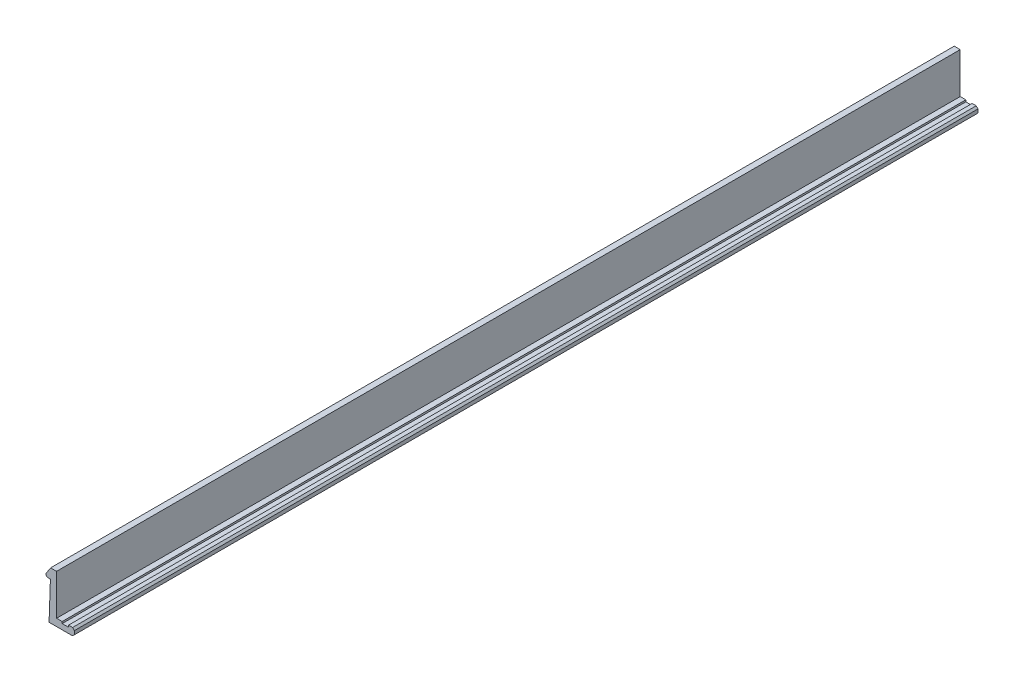
ISO-10303-21;
HEADER;
FILE_DESCRIPTION(('STEP AP214'),'2;1');
FILE_NAME('part.step','',(''),(''),'','','');
FILE_SCHEMA(('AUTOMOTIVE_DESIGN { 1 0 10303 214 1 1 1 1 }'));
ENDSEC;
DATA;
#1=APPLICATION_CONTEXT('core data for automotive mechanical design processes');
#2=APPLICATION_PROTOCOL_DEFINITION('international standard','automotive_design',2000,#1);
#3=PRODUCT_CONTEXT('',#1,'mechanical');
#4=PRODUCT('Part','Part','',(#3));
#5=PRODUCT_RELATED_PRODUCT_CATEGORY('part','',(#4));
#6=PRODUCT_DEFINITION_FORMATION('','',#4);
#7=PRODUCT_DEFINITION_CONTEXT('part definition',#1,'design');
#8=PRODUCT_DEFINITION('design','',#6,#7);
#9=PRODUCT_DEFINITION_SHAPE('','',#8);
#10=(LENGTH_UNIT() NAMED_UNIT(*) SI_UNIT(.MILLI.,.METRE.));
#11=(NAMED_UNIT(*) PLANE_ANGLE_UNIT() SI_UNIT($,.RADIAN.));
#12=(NAMED_UNIT(*) SI_UNIT($,.STERADIAN.) SOLID_ANGLE_UNIT());
#13=UNCERTAINTY_MEASURE_WITH_UNIT(LENGTH_MEASURE(1.E-05),#10,'distance_accuracy_value','');
#14=(GEOMETRIC_REPRESENTATION_CONTEXT(3) GLOBAL_UNCERTAINTY_ASSIGNED_CONTEXT((#13)) GLOBAL_UNIT_ASSIGNED_CONTEXT((#10,
#11,#12)) REPRESENTATION_CONTEXT('',''));
#15=CARTESIAN_POINT('',(0.,0.,0.));
#16=DIRECTION('',(0.,0.,1.));
#17=DIRECTION('',(1.,0.,0.));
#18=AXIS2_PLACEMENT_3D('',#15,#16,#17);
#19=CARTESIAN_POINT('',(-39.755712807522,-76.931131698235,0.));
#20=DIRECTION('',(0.707106781186547,0.707106781186547,0.));
#21=DIRECTION('',(-0.707106781186547,0.707106781186547,0.));
#22=AXIS2_PLACEMENT_3D('',#19,#20,#21);
#23=PLANE('',#22);
#24=DIRECTION('',(0.707106781186548,-0.707106781186548,0.));
#25=VECTOR('',#24,1.);
#26=CARTESIAN_POINT('',(-39.855712807522,-76.831131698235,100.));
#27=LINE('',#26,#25);
#28=CARTESIAN_POINT('',(-39.955712807522,-76.731131698235,100.));
#29=VERTEX_POINT('',#28);
#30=CARTESIAN_POINT('',(-39.755712807522,-76.931131698235,100.));
#31=VERTEX_POINT('',#30);
#32=EDGE_CURVE('E168',#29,#31,#27,.T.);
#33=ORIENTED_EDGE('',*,*,#32,.T.);
#34=DIRECTION('',(0.,0.,1.));
#35=VECTOR('',#34,1.);
#36=CARTESIAN_POINT('',(-39.755712807522,-76.931131698235,50.));
#37=LINE('',#36,#35);
#38=CARTESIAN_POINT('',(-39.755712807522,-76.931131698235,0.));
#39=VERTEX_POINT('',#38);
#40=EDGE_CURVE('E199',#39,#31,#37,.T.);
#41=ORIENTED_EDGE('',*,*,#40,.F.);
#42=DIRECTION('',(-0.707106781186548,0.707106781186548,0.));
#43=VECTOR('',#42,1.);
#44=CARTESIAN_POINT('',(-39.855712807522,-76.831131698235,0.));
#45=LINE('',#44,#43);
#46=CARTESIAN_POINT('',(-39.955712807522,-76.731131698235,0.));
#47=VERTEX_POINT('',#46);
#48=EDGE_CURVE('E170',#39,#47,#45,.T.);
#49=ORIENTED_EDGE('',*,*,#48,.T.);
#50=DIRECTION('',(0.,0.,-1.));
#51=VECTOR('',#50,1.);
#52=CARTESIAN_POINT('',(-39.955712807522,-76.731131698235,50.));
#53=LINE('',#52,#51);
#54=EDGE_CURVE('E139',#29,#47,#53,.T.);
#55=ORIENTED_EDGE('',*,*,#54,.F.);
#56=EDGE_LOOP('',(#33,#41,#49,#55));
#57=FACE_BOUND('',#56,.T.);
#58=ADVANCED_FACE('F17',(#57),#23,.T.);
#59=CARTESIAN_POINT('',(-39.955712807522,-76.731131698235,0.));
#60=DIRECTION('',(0.,1.,0.));
#61=DIRECTION('',(-1.,0.,0.));
#62=AXIS2_PLACEMENT_3D('',#59,#60,#61);
#63=PLANE('',#62);
#64=DIRECTION('',(1.,0.,0.));
#65=VECTOR('',#64,1.);
#66=CARTESIAN_POINT('',(-40.180712807522,-76.731131698235,100.));
#67=LINE('',#66,#65);
#68=CARTESIAN_POINT('',(-40.405712807522,-76.731131698235,100.));
#69=VERTEX_POINT('',#68);
#70=EDGE_CURVE('E162',#69,#29,#67,.T.);
#71=ORIENTED_EDGE('',*,*,#70,.T.);
#72=ORIENTED_EDGE('',*,*,#54,.T.);
#73=DIRECTION('',(-1.,0.,0.));
#74=VECTOR('',#73,1.);
#75=CARTESIAN_POINT('',(-40.180712807522,-76.731131698235,0.));
#76=LINE('',#75,#74);
#77=CARTESIAN_POINT('',(-40.405712807522,-76.731131698235,0.));
#78=VERTEX_POINT('',#77);
#79=EDGE_CURVE('E165',#47,#78,#76,.T.);
#80=ORIENTED_EDGE('',*,*,#79,.T.);
#81=DIRECTION('',(0.,0.,-1.));
#82=VECTOR('',#81,1.);
#83=CARTESIAN_POINT('',(-40.405712807522,-76.731131698235,50.));
#84=LINE('',#83,#82);
#85=EDGE_CURVE('E151',#69,#78,#84,.T.);
#86=ORIENTED_EDGE('',*,*,#85,.F.);
#87=EDGE_LOOP('',(#71,#72,#80,#86));
#88=FACE_BOUND('',#87,.T.);
#89=ADVANCED_FACE('F265',(#88),#63,.T.);
#90=CARTESIAN_POINT('',(-42.6957128075231,-73.1209991490537,0.));
#91=DIRECTION('',(0.,0.,1.));
#92=DIRECTION('',(1.,0.,0.));
#93=AXIS2_PLACEMENT_3D('',#90,#91,#92);
#94=CYLINDRICAL_SURFACE('',#93,0.199999999998741);
#95=CARTESIAN_POINT('',(-42.6957128075231,-73.1209991490537,100.));
#96=DIRECTION('',(0.,0.,1.));
#97=DIRECTION('',(1.,0.,0.));
#98=AXIS2_PLACEMENT_3D('',#95,#96,#97);
#99=CIRCLE('',#98,0.199999999998741);
#100=CARTESIAN_POINT('',(-42.7026927068625,-73.320877314454,100.));
#101=VERTEX_POINT('',#100);
#102=CARTESIAN_POINT('',(-42.895712807522,-73.1209991490533,100.));
#103=VERTEX_POINT('',#102);
#104=EDGE_CURVE('E138',#101,#103,#99,.F.);
#105=ORIENTED_EDGE('',*,*,#104,.T.);
#106=DIRECTION('',(0.,0.,1.));
#107=VECTOR('',#106,1.);
#108=CARTESIAN_POINT('',(-42.895712807522,-73.120999149053,50.));
#109=LINE('',#108,#107);
#110=CARTESIAN_POINT('',(-42.895712807522,-73.1209991490533,0.));
#111=VERTEX_POINT('',#110);
#112=EDGE_CURVE('E141',#111,#103,#109,.T.);
#113=ORIENTED_EDGE('',*,*,#112,.F.);
#114=CARTESIAN_POINT('',(-42.6957128075231,-73.1209991490537,0.));
#115=DIRECTION('',(0.,0.,1.));
#116=DIRECTION('',(1.,0.,0.));
#117=AXIS2_PLACEMENT_3D('',#114,#115,#116);
#118=CIRCLE('',#117,0.199999999998741);
#119=CARTESIAN_POINT('',(-42.7026927068625,-73.320877314454,0.));
#120=VERTEX_POINT('',#119);
#121=EDGE_CURVE('E21',#111,#120,#118,.T.);
#122=ORIENTED_EDGE('',*,*,#121,.T.);
#123=DIRECTION('',(0.,0.,-1.));
#124=VECTOR('',#123,1.);
#125=CARTESIAN_POINT('',(-42.702692706862,-73.320877314454,50.));
#126=LINE('',#125,#124);
#127=EDGE_CURVE('E208',#101,#120,#126,.T.);
#128=ORIENTED_EDGE('',*,*,#127,.F.);
#129=EDGE_LOOP('',(#105,#113,#122,#128));
#130=FACE_BOUND('',#129,.T.);
#131=ADVANCED_FACE('F142',(#130),#94,.T.);
#132=CARTESIAN_POINT('',(-39.755712807522,-77.331131698235,0.));
#133=DIRECTION('',(1.,0.,0.));
#134=DIRECTION('',(0.,1.,0.));
#135=AXIS2_PLACEMENT_3D('',#132,#133,#134);
#136=PLANE('',#135);
#137=DIRECTION('',(0.,-1.,0.));
#138=VECTOR('',#137,1.);
#139=CARTESIAN_POINT('',(-39.755712807522,-77.131131698235,100.));
#140=LINE('',#139,#138);
#141=CARTESIAN_POINT('',(-39.755712807522,-77.331131698235,100.));
#142=VERTEX_POINT('',#141);
#143=EDGE_CURVE('E204',#31,#142,#140,.T.);
#144=ORIENTED_EDGE('',*,*,#143,.T.);
#145=DIRECTION('',(0.,0.,1.));
#146=VECTOR('',#145,1.);
#147=CARTESIAN_POINT('',(-39.755712807522,-77.331131698235,50.));
#148=LINE('',#147,#146);
#149=CARTESIAN_POINT('',(-39.755712807522,-77.331131698235,0.));
#150=VERTEX_POINT('',#149);
#151=EDGE_CURVE('E240',#150,#142,#148,.T.);
#152=ORIENTED_EDGE('',*,*,#151,.F.);
#153=DIRECTION('',(0.,1.,0.));
#154=VECTOR('',#153,1.);
#155=CARTESIAN_POINT('',(-39.755712807522,-77.131131698235,0.));
#156=LINE('',#155,#154);
#157=EDGE_CURVE('E197',#150,#39,#156,.T.);
#158=ORIENTED_EDGE('',*,*,#157,.T.);
#159=ORIENTED_EDGE('',*,*,#40,.T.);
#160=EDGE_LOOP('',(#144,#152,#158,#159));
#161=FACE_BOUND('',#160,.T.);
#162=ADVANCED_FACE('F251',(#161),#136,.T.);
#163=CARTESIAN_POINT('',(-40.405712807522,-76.731131698235,0.));
#164=DIRECTION('',(-1.,0.,0.));
#165=DIRECTION('',(0.,-1.,0.));
#166=AXIS2_PLACEMENT_3D('',#163,#164,#165);
#167=PLANE('',#166);
#168=DIRECTION('',(0.,1.,0.));
#169=VECTOR('',#168,1.);
#170=CARTESIAN_POINT('',(-40.405712807522,-76.831131698235,100.));
#171=LINE('',#170,#169);
#172=CARTESIAN_POINT('',(-40.405712807522,-76.931131698235,100.));
#173=VERTEX_POINT('',#172);
#174=EDGE_CURVE('E154',#173,#69,#171,.T.);
#175=ORIENTED_EDGE('',*,*,#174,.T.);
#176=ORIENTED_EDGE('',*,*,#85,.T.);
#177=DIRECTION('',(0.,-1.,0.));
#178=VECTOR('',#177,1.);
#179=CARTESIAN_POINT('',(-40.405712807522,-76.831131698235,0.));
#180=LINE('',#179,#178);
#181=CARTESIAN_POINT('',(-40.405712807522,-76.931131698235,0.));
#182=VERTEX_POINT('',#181);
#183=EDGE_CURVE('E247',#78,#182,#180,.T.);
#184=ORIENTED_EDGE('',*,*,#183,.T.);
#185=DIRECTION('',(0.,0.,-1.));
#186=VECTOR('',#185,1.);
#187=CARTESIAN_POINT('',(-40.405712807522,-76.931131698235,50.));
#188=LINE('',#187,#186);
#189=EDGE_CURVE('E224',#173,#182,#188,.T.);
#190=ORIENTED_EDGE('',*,*,#189,.F.);
#191=EDGE_LOOP('',(#175,#176,#184,#190));
#192=FACE_BOUND('',#191,.T.);
#193=ADVANCED_FACE('F267',(#192),#167,.T.);
#194=CARTESIAN_POINT('',(-42.895712807522,-73.013831698234,0.));
#195=DIRECTION('',(-1.,0.,0.));
#196=DIRECTION('',(0.,-1.,0.));
#197=AXIS2_PLACEMENT_3D('',#194,#195,#196);
#198=PLANE('',#197);
#199=DIRECTION('',(0.,1.,0.));
#200=VECTOR('',#199,1.);
#201=CARTESIAN_POINT('',(-42.895712807522,-73.0674154236435,100.));
#202=LINE('',#201,#200);
#203=CARTESIAN_POINT('',(-42.895712807522,-73.013831698234,100.));
#204=VERTEX_POINT('',#203);
#205=EDGE_CURVE('E145',#103,#204,#202,.T.);
#206=ORIENTED_EDGE('',*,*,#205,.T.);
#207=DIRECTION('',(0.,0.,1.));
#208=VECTOR('',#207,1.);
#209=CARTESIAN_POINT('',(-42.895712807522,-73.013831698234,50.));
#210=LINE('',#209,#208);
#211=CARTESIAN_POINT('',(-42.895712807522,-73.013831698234,0.));
#212=VERTEX_POINT('',#211);
#213=EDGE_CURVE('E149',#212,#204,#210,.T.);
#214=ORIENTED_EDGE('',*,*,#213,.F.);
#215=DIRECTION('',(0.,-1.,0.));
#216=VECTOR('',#215,1.);
#217=CARTESIAN_POINT('',(-42.895712807522,-73.0674154236435,0.));
#218=LINE('',#217,#216);
#219=EDGE_CURVE('E131',#212,#111,#218,.T.);
#220=ORIENTED_EDGE('',*,*,#219,.T.);
#221=ORIENTED_EDGE('',*,*,#112,.T.);
#222=EDGE_LOOP('',(#206,#214,#220,#221));
#223=FACE_BOUND('',#222,.T.);
#224=ADVANCED_FACE('F147',(#223),#198,.T.);
#225=CARTESIAN_POINT('',(-42.702692706862,-73.320877314454,0.));
#226=DIRECTION('',(-0.0348994967000746,-0.999390827019181,0.));
#227=DIRECTION('',(0.999390827019181,-0.0348994967000746,0.));
#228=AXIS2_PLACEMENT_3D('',#225,#226,#227);
#229=PLANE('',#228);
#230=DIRECTION('',(-0.99939082701918,0.0348994967000746,0.));
#231=VECTOR('',#230,1.);
#232=CARTESIAN_POINT('',(-42.5558691412595,-73.326004506344,100.));
#233=LINE('',#232,#231);
#234=CARTESIAN_POINT('',(-42.409045575657,-73.331131698234,100.));
#235=VERTEX_POINT('',#234);
#236=EDGE_CURVE('E211',#235,#101,#233,.T.);
#237=ORIENTED_EDGE('',*,*,#236,.T.);
#238=ORIENTED_EDGE('',*,*,#127,.T.);
#239=DIRECTION('',(0.99939082701918,-0.0348994967000746,0.));
#240=VECTOR('',#239,1.);
#241=CARTESIAN_POINT('',(-42.5558691412595,-73.326004506344,0.));
#242=LINE('',#241,#240);
#243=CARTESIAN_POINT('',(-42.409045575657,-73.331131698234,0.));
#244=VERTEX_POINT('',#243);
#245=EDGE_CURVE('E134',#120,#244,#242,.T.);
#246=ORIENTED_EDGE('',*,*,#245,.T.);
#247=DIRECTION('',(0.,0.,-1.));
#248=VECTOR('',#247,1.);
#249=CARTESIAN_POINT('',(-42.409045575657,-73.331131698234,50.));
#250=LINE('',#249,#248);
#251=EDGE_CURVE('E214',#235,#244,#250,.T.);
#252=ORIENTED_EDGE('',*,*,#251,.F.);
#253=EDGE_LOOP('',(#237,#238,#246,#252));
#254=FACE_BOUND('',#253,.T.);
#255=ADVANCED_FACE('F340',(#254),#229,.T.);
#256=CARTESIAN_POINT('',(-39.955712807522,-77.531131698235,0.));
#257=DIRECTION('',(0.707106781186572,-0.707106781186523,0.));
#258=DIRECTION('',(0.707106781186523,0.707106781186572,0.));
#259=AXIS2_PLACEMENT_3D('',#256,#257,#258);
#260=PLANE('',#259);
#261=DIRECTION('',(-0.707106781186523,-0.707106781186572,0.));
#262=VECTOR('',#261,1.);
#263=CARTESIAN_POINT('',(-39.855712807522,-77.431131698235,100.));
#264=LINE('',#263,#262);
#265=CARTESIAN_POINT('',(-39.955712807522,-77.531131698235,100.));
#266=VERTEX_POINT('',#265);
#267=EDGE_CURVE('E238',#142,#266,#264,.T.);
#268=ORIENTED_EDGE('',*,*,#267,.T.);
#269=DIRECTION('',(0.,0.,1.));
#270=VECTOR('',#269,1.);
#271=CARTESIAN_POINT('',(-39.955712807522,-77.531131698235,50.));
#272=LINE('',#271,#270);
#273=CARTESIAN_POINT('',(-39.955712807522,-77.531131698235,0.));
#274=VERTEX_POINT('',#273);
#275=EDGE_CURVE('E184',#274,#266,#272,.T.);
#276=ORIENTED_EDGE('',*,*,#275,.F.);
#277=DIRECTION('',(0.707106781186523,0.707106781186572,0.));
#278=VECTOR('',#277,1.);
#279=CARTESIAN_POINT('',(-39.855712807522,-77.431131698235,0.));
#280=LINE('',#279,#278);
#281=EDGE_CURVE('E210',#274,#150,#280,.T.);
#282=ORIENTED_EDGE('',*,*,#281,.T.);
#283=ORIENTED_EDGE('',*,*,#151,.T.);
#284=EDGE_LOOP('',(#268,#276,#282,#283));
#285=FACE_BOUND('',#284,.T.);
#286=ADVANCED_FACE('F259',(#285),#260,.T.);
#287=CARTESIAN_POINT('',(-40.405712807522,-76.931131698235,0.));
#288=DIRECTION('',(0.,1.,0.));
#289=DIRECTION('',(-1.,0.,0.));
#290=AXIS2_PLACEMENT_3D('',#287,#288,#289);
#291=PLANE('',#290);
#292=DIRECTION('',(1.,0.,0.));
#293=VECTOR('',#292,1.);
#294=CARTESIAN_POINT('',(-40.755712807522,-76.931131698235,100.));
#295=LINE('',#294,#293);
#296=CARTESIAN_POINT('',(-41.105712807522,-76.931131698235,100.));
#297=VERTEX_POINT('',#296);
#298=EDGE_CURVE('E227',#297,#173,#295,.T.);
#299=ORIENTED_EDGE('',*,*,#298,.T.);
#300=ORIENTED_EDGE('',*,*,#189,.T.);
#301=DIRECTION('',(-1.,0.,0.));
#302=VECTOR('',#301,1.);
#303=CARTESIAN_POINT('',(-40.755712807522,-76.931131698235,0.));
#304=LINE('',#303,#302);
#305=CARTESIAN_POINT('',(-41.105712807522,-76.931131698235,0.));
#306=VERTEX_POINT('',#305);
#307=EDGE_CURVE('E232',#182,#306,#304,.T.);
#308=ORIENTED_EDGE('',*,*,#307,.T.);
#309=DIRECTION('',(0.,0.,-1.));
#310=VECTOR('',#309,1.);
#311=CARTESIAN_POINT('',(-41.105712807522,-76.931131698235,50.));
#312=LINE('',#311,#310);
#313=EDGE_CURVE('E183',#297,#306,#312,.T.);
#314=ORIENTED_EDGE('',*,*,#313,.F.);
#315=EDGE_LOOP('',(#299,#300,#308,#314));
#316=FACE_BOUND('',#315,.T.);
#317=ADVANCED_FACE('F269',(#316),#291,.T.);
#318=CARTESIAN_POINT('',(-42.387421484326,-72.231131698235,0.));
#319=DIRECTION('',(-0.838670567944952,0.544639035015754,0.));
#320=DIRECTION('',(-0.544639035015754,-0.838670567944952,0.));
#321=AXIS2_PLACEMENT_3D('',#318,#319,#320);
#322=PLANE('',#321);
#323=DIRECTION('',(0.544639035015754,0.838670567944952,0.));
#324=VECTOR('',#323,1.);
#325=CARTESIAN_POINT('',(-42.641567145924,-72.6224816982345,100.));
#326=LINE('',#325,#324);
#327=CARTESIAN_POINT('',(-42.387421484326,-72.231131698235,100.));
#328=VERTEX_POINT('',#327);
#329=EDGE_CURVE('E217',#204,#328,#326,.T.);
#330=ORIENTED_EDGE('',*,*,#329,.T.);
#331=DIRECTION('',(0.,0.,1.));
#332=VECTOR('',#331,1.);
#333=CARTESIAN_POINT('',(-42.387421484326,-72.231131698235,50.));
#334=LINE('',#333,#332);
#335=CARTESIAN_POINT('',(-42.387421484326,-72.231131698235,0.));
#336=VERTEX_POINT('',#335);
#337=EDGE_CURVE('E173',#336,#328,#334,.T.);
#338=ORIENTED_EDGE('',*,*,#337,.F.);
#339=DIRECTION('',(0.544639035015749,0.838670567944955,0.));
#340=VECTOR('',#339,1.);
#341=CARTESIAN_POINT('',(-42.895712807522,-73.013831698234,0.));
#342=LINE('',#341,#340);
#343=EDGE_CURVE('E196',#212,#336,#342,.T.);
#344=ORIENTED_EDGE('',*,*,#343,.F.);
#345=ORIENTED_EDGE('',*,*,#213,.T.);
#346=EDGE_LOOP('',(#330,#338,#344,#345));
#347=FACE_BOUND('',#346,.T.);
#348=ADVANCED_FACE('F304',(#347),#322,.T.);
#349=CARTESIAN_POINT('',(-42.409045575657,-73.331131698234,0.));
#350=DIRECTION('',(-0.999390827019099,0.0348994967024124,0.));
#351=DIRECTION('',(-0.0348994967024124,-0.999390827019099,0.));
#352=AXIS2_PLACEMENT_3D('',#349,#350,#351);
#353=PLANE('',#352);
#354=DIRECTION('',(-0.034899496702414,-0.999390827019099,0.));
#355=VECTOR('',#354,1.);
#356=CARTESIAN_POINT('',(-42.409045575657,-73.331131698234,100.));
#357=LINE('',#356,#355);
#358=CARTESIAN_POINT('',(-42.555712807522,-77.531131698235,100.));
#359=VERTEX_POINT('',#358);
#360=EDGE_CURVE('E176',#235,#359,#357,.T.);
#361=ORIENTED_EDGE('',*,*,#360,.F.);
#362=ORIENTED_EDGE('',*,*,#251,.T.);
#363=DIRECTION('',(0.034899496702414,0.999390827019099,0.));
#364=VECTOR('',#363,1.);
#365=CARTESIAN_POINT('',(-42.555712807522,-77.531131698235,0.));
#366=LINE('',#365,#364);
#367=CARTESIAN_POINT('',(-42.555712807522,-77.531131698235,0.));
#368=VERTEX_POINT('',#367);
#369=EDGE_CURVE('E180',#368,#244,#366,.T.);
#370=ORIENTED_EDGE('',*,*,#369,.F.);
#371=DIRECTION('',(0.,0.,-1.));
#372=VECTOR('',#371,1.);
#373=CARTESIAN_POINT('',(-42.555712807522,-77.531131698235,50.));
#374=LINE('',#373,#372);
#375=EDGE_CURVE('E181',#359,#368,#374,.T.);
#376=ORIENTED_EDGE('',*,*,#375,.F.);
#377=EDGE_LOOP('',(#361,#362,#370,#376));
#378=FACE_BOUND('',#377,.T.);
#379=ADVANCED_FACE('F306',(#378),#353,.T.);
#380=CARTESIAN_POINT('',(-42.555712807522,-77.531131698235,0.));
#381=DIRECTION('',(0.,-1.,0.));
#382=DIRECTION('',(1.,0.,0.));
#383=AXIS2_PLACEMENT_3D('',#380,#381,#382);
#384=PLANE('',#383);
#385=DIRECTION('',(1.,0.,0.));
#386=VECTOR('',#385,1.);
#387=CARTESIAN_POINT('',(-41.325713220582,-77.531131698235,100.));
#388=LINE('',#387,#386);
#389=EDGE_CURVE('E189',#359,#266,#388,.T.);
#390=ORIENTED_EDGE('',*,*,#389,.F.);
#391=ORIENTED_EDGE('',*,*,#375,.T.);
#392=DIRECTION('',(-1.,0.,0.));
#393=VECTOR('',#392,1.);
#394=CARTESIAN_POINT('',(-41.325713220582,-77.531131698235,0.));
#395=LINE('',#394,#393);
#396=EDGE_CURVE('E185',#274,#368,#395,.T.);
#397=ORIENTED_EDGE('',*,*,#396,.F.);
#398=ORIENTED_EDGE('',*,*,#275,.T.);
#399=EDGE_LOOP('',(#390,#391,#397,#398));
#400=FACE_BOUND('',#399,.T.);
#401=ADVANCED_FACE('F313',(#400),#384,.T.);
#402=CARTESIAN_POINT('',(-41.105712807522,-76.931131698235,0.));
#403=DIRECTION('',(1.,0.,0.));
#404=DIRECTION('',(0.,1.,0.));
#405=AXIS2_PLACEMENT_3D('',#402,#403,#404);
#406=PLANE('',#405);
#407=DIRECTION('',(0.,1.,0.));
#408=VECTOR('',#407,1.);
#409=CARTESIAN_POINT('',(-41.105712807522,-74.8811315432625,100.));
#410=LINE('',#409,#408);
#411=CARTESIAN_POINT('',(-41.105712807522,-76.731131698235,100.));
#412=VERTEX_POINT('',#411);
#413=EDGE_CURVE('E192',#297,#412,#410,.T.);
#414=ORIENTED_EDGE('',*,*,#413,.F.);
#415=ORIENTED_EDGE('',*,*,#313,.T.);
#416=DIRECTION('',(0.,-1.,0.));
#417=VECTOR('',#416,1.);
#418=CARTESIAN_POINT('',(-41.105712807522,-74.8811315432625,0.));
#419=LINE('',#418,#417);
#420=CARTESIAN_POINT('',(-41.105712807522,-76.731131698235,0.));
#421=VERTEX_POINT('',#420);
#422=EDGE_CURVE('E188',#421,#306,#419,.T.);
#423=ORIENTED_EDGE('',*,*,#422,.F.);
#424=DIRECTION('',(0.,0.,-1.));
#425=VECTOR('',#424,1.);
#426=CARTESIAN_POINT('',(-41.105712807522,-76.731131698235,50.));
#427=LINE('',#426,#425);
#428=EDGE_CURVE('E277',#412,#421,#427,.T.);
#429=ORIENTED_EDGE('',*,*,#428,.F.);
#430=EDGE_LOOP('',(#414,#415,#423,#429));
#431=FACE_BOUND('',#430,.T.);
#432=ADVANCED_FACE('F278',(#431),#406,.T.);
#433=CARTESIAN_POINT('',(-42.974211919651,-72.098630262955,0.));
#434=DIRECTION('',(0.,0.,-1.));
#435=DIRECTION('',(1.,0.,0.));
#436=AXIS2_PLACEMENT_3D('',#433,#434,#435);
#437=PLANE('',#436);
#438=ORIENTED_EDGE('',*,*,#245,.F.);
#439=ORIENTED_EDGE('',*,*,#121,.F.);
#440=ORIENTED_EDGE('',*,*,#219,.F.);
#441=ORIENTED_EDGE('',*,*,#343,.T.);
#442=DIRECTION('',(-1.,0.,0.));
#443=VECTOR('',#442,1.);
#444=CARTESIAN_POINT('',(-42.056567145924,-72.231131698235,0.));
#445=LINE('',#444,#443);
#446=CARTESIAN_POINT('',(-41.725712807522,-72.231131698235,0.));
#447=VERTEX_POINT('',#446);
#448=EDGE_CURVE('E177',#447,#336,#445,.T.);
#449=ORIENTED_EDGE('',*,*,#448,.F.);
#450=DIRECTION('',(0.,1.,0.));
#451=VECTOR('',#450,1.);
#452=CARTESIAN_POINT('',(-41.725712807522,-74.481131698235,0.));
#453=LINE('',#452,#451);
#454=CARTESIAN_POINT('',(-41.725712807522,-76.731131698235,0.));
#455=VERTEX_POINT('',#454);
#456=EDGE_CURVE('E283',#455,#447,#453,.T.);
#457=ORIENTED_EDGE('',*,*,#456,.F.);
#458=DIRECTION('',(-1.,0.,0.));
#459=VECTOR('',#458,1.);
#460=CARTESIAN_POINT('',(-41.415712807522,-76.731131698235,0.));
#461=LINE('',#460,#459);
#462=EDGE_CURVE('E287',#421,#455,#461,.T.);
#463=ORIENTED_EDGE('',*,*,#462,.F.);
#464=ORIENTED_EDGE('',*,*,#422,.T.);
#465=ORIENTED_EDGE('',*,*,#307,.F.);
#466=ORIENTED_EDGE('',*,*,#183,.F.);
#467=ORIENTED_EDGE('',*,*,#79,.F.);
#468=ORIENTED_EDGE('',*,*,#48,.F.);
#469=ORIENTED_EDGE('',*,*,#157,.F.);
#470=ORIENTED_EDGE('',*,*,#281,.F.);
#471=ORIENTED_EDGE('',*,*,#396,.T.);
#472=ORIENTED_EDGE('',*,*,#369,.T.);
#473=EDGE_LOOP('',(#438,#439,#440,#441,#449,#457,#463,#464,#465,#466,#467,#468,#469,#470,#471,#472));
#474=FACE_BOUND('',#473,.T.);
#475=ADVANCED_FACE('F129',(#474),#437,.T.);
#476=CARTESIAN_POINT('',(-41.725712807522,-72.231131698235,0.));
#477=DIRECTION('',(0.,1.,0.));
#478=DIRECTION('',(-1.,0.,0.));
#479=AXIS2_PLACEMENT_3D('',#476,#477,#478);
#480=PLANE('',#479);
#481=DIRECTION('',(-1.,0.,0.));
#482=VECTOR('',#481,1.);
#483=CARTESIAN_POINT('',(-41.325713220582,-72.231131698235,100.));
#484=LINE('',#483,#482);
#485=CARTESIAN_POINT('',(-41.725712807522,-72.231131698235,100.));
#486=VERTEX_POINT('',#485);
#487=EDGE_CURVE('E274',#486,#328,#484,.T.);
#488=ORIENTED_EDGE('',*,*,#487,.F.);
#489=DIRECTION('',(0.,0.,1.));
#490=VECTOR('',#489,1.);
#491=CARTESIAN_POINT('',(-41.725712807522,-72.231131698235,50.));
#492=LINE('',#491,#490);
#493=EDGE_CURVE('E298',#447,#486,#492,.T.);
#494=ORIENTED_EDGE('',*,*,#493,.F.);
#495=ORIENTED_EDGE('',*,*,#448,.T.);
#496=ORIENTED_EDGE('',*,*,#337,.T.);
#497=EDGE_LOOP('',(#488,#494,#495,#496));
#498=FACE_BOUND('',#497,.T.);
#499=ADVANCED_FACE('F302',(#498),#480,.T.);
#500=CARTESIAN_POINT('',(-39.677214521513,-77.66363282357,100.));
#501=DIRECTION('',(0.,0.,1.));
#502=DIRECTION('',(0.,1.,0.));
#503=AXIS2_PLACEMENT_3D('',#500,#501,#502);
#504=PLANE('',#503);
#505=ORIENTED_EDGE('',*,*,#329,.F.);
#506=ORIENTED_EDGE('',*,*,#205,.F.);
#507=ORIENTED_EDGE('',*,*,#104,.F.);
#508=ORIENTED_EDGE('',*,*,#236,.F.);
#509=ORIENTED_EDGE('',*,*,#360,.T.);
#510=ORIENTED_EDGE('',*,*,#389,.T.);
#511=ORIENTED_EDGE('',*,*,#267,.F.);
#512=ORIENTED_EDGE('',*,*,#143,.F.);
#513=ORIENTED_EDGE('',*,*,#32,.F.);
#514=ORIENTED_EDGE('',*,*,#70,.F.);
#515=ORIENTED_EDGE('',*,*,#174,.F.);
#516=ORIENTED_EDGE('',*,*,#298,.F.);
#517=ORIENTED_EDGE('',*,*,#413,.T.);
#518=DIRECTION('',(1.,0.,0.));
#519=VECTOR('',#518,1.);
#520=CARTESIAN_POINT('',(-41.415712807522,-76.731131698235,100.));
#521=LINE('',#520,#519);
#522=CARTESIAN_POINT('',(-41.725712807522,-76.731131698235,100.));
#523=VERTEX_POINT('',#522);
#524=EDGE_CURVE('E36',#523,#412,#521,.T.);
#525=ORIENTED_EDGE('',*,*,#524,.F.);
#526=DIRECTION('',(0.,-1.,0.));
#527=VECTOR('',#526,1.);
#528=CARTESIAN_POINT('',(-41.725712807522,-74.481131698235,100.));
#529=LINE('',#528,#527);
#530=EDGE_CURVE('E27',#486,#523,#529,.T.);
#531=ORIENTED_EDGE('',*,*,#530,.F.);
#532=ORIENTED_EDGE('',*,*,#487,.T.);
#533=EDGE_LOOP('',(#505,#506,#507,#508,#509,#510,#511,#512,#513,#514,#515,#516,#517,#525,#531,#532));
#534=FACE_BOUND('',#533,.T.);
#535=ADVANCED_FACE('F254',(#534),#504,.T.);
#536=CARTESIAN_POINT('',(-41.105712807522,-76.731131698235,0.));
#537=DIRECTION('',(0.,1.,0.));
#538=DIRECTION('',(-1.,0.,0.));
#539=AXIS2_PLACEMENT_3D('',#536,#537,#538);
#540=PLANE('',#539);
#541=ORIENTED_EDGE('',*,*,#524,.T.);
#542=ORIENTED_EDGE('',*,*,#428,.T.);
#543=ORIENTED_EDGE('',*,*,#462,.T.);
#544=DIRECTION('',(0.,0.,-1.));
#545=VECTOR('',#544,1.);
#546=CARTESIAN_POINT('',(-41.725712807522,-76.731131698235,50.));
#547=LINE('',#546,#545);
#548=EDGE_CURVE('E11',#523,#455,#547,.T.);
#549=ORIENTED_EDGE('',*,*,#548,.F.);
#550=EDGE_LOOP('',(#541,#542,#543,#549));
#551=FACE_BOUND('',#550,.T.);
#552=ADVANCED_FACE('F285',(#551),#540,.T.);
#553=CARTESIAN_POINT('',(-41.725712807522,-76.731131698235,0.));
#554=DIRECTION('',(1.,0.,0.));
#555=DIRECTION('',(0.,1.,0.));
#556=AXIS2_PLACEMENT_3D('',#553,#554,#555);
#557=PLANE('',#556);
#558=ORIENTED_EDGE('',*,*,#530,.T.);
#559=ORIENTED_EDGE('',*,*,#548,.T.);
#560=ORIENTED_EDGE('',*,*,#456,.T.);
#561=ORIENTED_EDGE('',*,*,#493,.T.);
#562=EDGE_LOOP('',(#558,#559,#560,#561));
#563=FACE_BOUND('',#562,.T.);
#564=ADVANCED_FACE('F19',(#563),#557,.T.);
#565=CLOSED_SHELL('',(#58,#89,#131,#162,#193,#224,#255,#286,#317,#348,#379,#401,#432,#475,#499,
#535,#552,#564));
#566=MANIFOLD_SOLID_BREP('B1',#565);
#567=ADVANCED_BREP_SHAPE_REPRESENTATION('',(#18,#566),#14);
#568=SHAPE_DEFINITION_REPRESENTATION(#9,#567);
ENDSEC;
END-ISO-10303-21;
